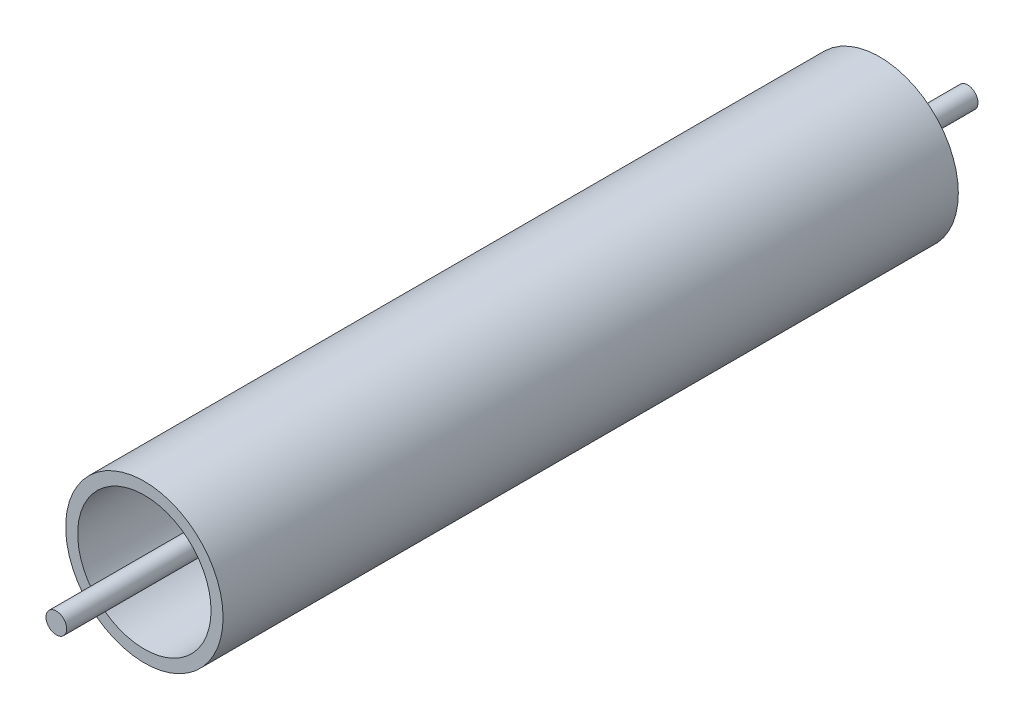
ISO-10303-21;
HEADER;
FILE_DESCRIPTION(('STEP AP214'),'2;1');
FILE_NAME('part.step','',(''),(''),'','','');
FILE_SCHEMA(('AUTOMOTIVE_DESIGN { 1 0 10303 214 1 1 1 1 }'));
ENDSEC;
DATA;
#1=APPLICATION_CONTEXT('core data for automotive mechanical design processes');
#2=APPLICATION_PROTOCOL_DEFINITION('international standard','automotive_design',2000,#1);
#3=PRODUCT_CONTEXT('',#1,'mechanical');
#4=PRODUCT('Part','Part','',(#3));
#5=PRODUCT_RELATED_PRODUCT_CATEGORY('part','',(#4));
#6=PRODUCT_DEFINITION_FORMATION('','',#4);
#7=PRODUCT_DEFINITION_CONTEXT('part definition',#1,'design');
#8=PRODUCT_DEFINITION('design','',#6,#7);
#9=PRODUCT_DEFINITION_SHAPE('','',#8);
#10=(LENGTH_UNIT() NAMED_UNIT(*) SI_UNIT(.MILLI.,.METRE.));
#11=(NAMED_UNIT(*) PLANE_ANGLE_UNIT() SI_UNIT($,.RADIAN.));
#12=(NAMED_UNIT(*) SI_UNIT($,.STERADIAN.) SOLID_ANGLE_UNIT());
#13=UNCERTAINTY_MEASURE_WITH_UNIT(LENGTH_MEASURE(1.E-05),#10,'distance_accuracy_value','');
#14=(GEOMETRIC_REPRESENTATION_CONTEXT(3) GLOBAL_UNCERTAINTY_ASSIGNED_CONTEXT((#13)) GLOBAL_UNIT_ASSIGNED_CONTEXT((#10,
#11,#12)) REPRESENTATION_CONTEXT('',''));
#15=CARTESIAN_POINT('',(0.,0.,0.));
#16=DIRECTION('',(0.,0.,1.));
#17=DIRECTION('',(1.,0.,0.));
#18=AXIS2_PLACEMENT_3D('',#15,#16,#17);
#19=CARTESIAN_POINT('',(0.,0.,112.7125));
#20=DIRECTION('',(0.,0.,1.));
#21=DIRECTION('',(1.,0.,0.));
#22=AXIS2_PLACEMENT_3D('',#19,#20,#21);
#23=PLANE('',#22);
#24=CARTESIAN_POINT('',(0.,0.,112.7125));
#25=DIRECTION('',(0.,0.,1.));
#26=DIRECTION('',(1.,0.,0.));
#27=AXIS2_PLACEMENT_3D('',#24,#25,#26);
#28=CIRCLE('',#27,24.13);
#29=CARTESIAN_POINT('',(24.13,0.,112.7125));
#30=VERTEX_POINT('',#29);
#31=EDGE_CURVE('E11',#30,#30,#28,.T.);
#32=ORIENTED_EDGE('',*,*,#31,.T.);
#33=EDGE_LOOP('',(#32));
#34=FACE_BOUND('',#33,.T.);
#35=CARTESIAN_POINT('',(0.,0.,112.7125));
#36=DIRECTION('',(0.,0.,1.));
#37=DIRECTION('',(1.,0.,0.));
#38=AXIS2_PLACEMENT_3D('',#35,#36,#37);
#39=CIRCLE('',#38,20.447);
#40=CARTESIAN_POINT('',(20.447,0.,112.7125));
#41=VERTEX_POINT('',#40);
#42=EDGE_CURVE('E58',#41,#41,#39,.T.);
#43=ORIENTED_EDGE('',*,*,#42,.F.);
#44=EDGE_LOOP('',(#43));
#45=FACE_BOUND('',#44,.T.);
#46=ADVANCED_FACE('F45',(#34,#45),#23,.T.);
#47=CARTESIAN_POINT('',(0.,0.,-112.7125));
#48=DIRECTION('',(0.,0.,1.));
#49=DIRECTION('',(1.,0.,0.));
#50=AXIS2_PLACEMENT_3D('',#47,#48,#49);
#51=PLANE('',#50);
#52=CARTESIAN_POINT('',(0.,0.,-112.7125));
#53=DIRECTION('',(0.,0.,1.));
#54=DIRECTION('',(1.,0.,0.));
#55=AXIS2_PLACEMENT_3D('',#52,#53,#54);
#56=CIRCLE('',#55,24.13);
#57=CARTESIAN_POINT('',(24.13,0.,-112.7125));
#58=VERTEX_POINT('',#57);
#59=EDGE_CURVE('E49',#58,#58,#56,.T.);
#60=ORIENTED_EDGE('',*,*,#59,.F.);
#61=EDGE_LOOP('',(#60));
#62=FACE_BOUND('',#61,.T.);
#63=CARTESIAN_POINT('',(0.,0.,-112.7125));
#64=DIRECTION('',(0.,0.,1.));
#65=DIRECTION('',(1.,0.,0.));
#66=AXIS2_PLACEMENT_3D('',#63,#64,#65);
#67=CIRCLE('',#66,20.447);
#68=CARTESIAN_POINT('',(20.447,0.,-112.7125));
#69=VERTEX_POINT('',#68);
#70=EDGE_CURVE('E60',#69,#69,#67,.T.);
#71=ORIENTED_EDGE('',*,*,#70,.T.);
#72=EDGE_LOOP('',(#71));
#73=FACE_BOUND('',#72,.T.);
#74=ADVANCED_FACE('F72',(#62,#73),#51,.F.);
#75=CARTESIAN_POINT('',(0.,0.,112.7125));
#76=DIRECTION('',(0.,0.,-1.));
#77=DIRECTION('',(-1.,0.,0.));
#78=AXIS2_PLACEMENT_3D('',#75,#76,#77);
#79=CYLINDRICAL_SURFACE('',#78,24.13);
#80=ORIENTED_EDGE('',*,*,#31,.F.);
#81=EDGE_LOOP('',(#80));
#82=FACE_BOUND('',#81,.T.);
#83=ORIENTED_EDGE('',*,*,#59,.T.);
#84=EDGE_LOOP('',(#83));
#85=FACE_BOUND('',#84,.T.);
#86=ADVANCED_FACE('F47',(#82,#85),#79,.T.);
#87=CARTESIAN_POINT('',(0.,0.,112.7125));
#88=DIRECTION('',(0.,0.,-1.));
#89=DIRECTION('',(-1.,0.,0.));
#90=AXIS2_PLACEMENT_3D('',#87,#88,#89);
#91=CYLINDRICAL_SURFACE('',#90,20.447);
#92=ORIENTED_EDGE('',*,*,#42,.T.);
#93=EDGE_LOOP('',(#92));
#94=FACE_BOUND('',#93,.T.);
#95=ORIENTED_EDGE('',*,*,#70,.F.);
#96=EDGE_LOOP('',(#95));
#97=FACE_BOUND('',#96,.T.);
#98=ADVANCED_FACE('F68',(#94,#97),#91,.F.);
#99=CLOSED_SHELL('',(#46,#74,#86,#98));
#100=MANIFOLD_SOLID_BREP('B2',#99);
#101=CARTESIAN_POINT('',(0.,0.,139.7));
#102=DIRECTION('',(0.,0.,-1.));
#103=DIRECTION('',(-1.,0.,0.));
#104=AXIS2_PLACEMENT_3D('',#101,#102,#103);
#105=CYLINDRICAL_SURFACE('',#104,3.175);
#106=CARTESIAN_POINT('',(0.,0.,139.7));
#107=DIRECTION('',(0.,0.,1.));
#108=DIRECTION('',(1.,0.,0.));
#109=AXIS2_PLACEMENT_3D('',#106,#107,#108);
#110=CIRCLE('',#109,3.175);
#111=CARTESIAN_POINT('',(3.175,0.,139.7));
#112=VERTEX_POINT('',#111);
#113=EDGE_CURVE('E44',#112,#112,#110,.T.);
#114=ORIENTED_EDGE('',*,*,#113,.F.);
#115=EDGE_LOOP('',(#114));
#116=FACE_BOUND('',#115,.T.);
#117=CARTESIAN_POINT('',(0.,0.,-139.7));
#118=DIRECTION('',(0.,0.,1.));
#119=DIRECTION('',(1.,0.,0.));
#120=AXIS2_PLACEMENT_3D('',#117,#118,#119);
#121=CIRCLE('',#120,3.175);
#122=CARTESIAN_POINT('',(3.175,0.,-139.7));
#123=VERTEX_POINT('',#122);
#124=EDGE_CURVE('E114',#123,#123,#121,.T.);
#125=ORIENTED_EDGE('',*,*,#124,.T.);
#126=EDGE_LOOP('',(#125));
#127=FACE_BOUND('',#126,.T.);
#128=ADVANCED_FACE('F111',(#116,#127),#105,.T.);
#129=CARTESIAN_POINT('',(0.,0.,139.7));
#130=DIRECTION('',(0.,0.,1.));
#131=DIRECTION('',(1.,0.,0.));
#132=AXIS2_PLACEMENT_3D('',#129,#130,#131);
#133=PLANE('',#132);
#134=ORIENTED_EDGE('',*,*,#113,.T.);
#135=EDGE_LOOP('',(#134));
#136=FACE_BOUND('',#135,.T.);
#137=ADVANCED_FACE('F126',(#136),#133,.T.);
#138=CARTESIAN_POINT('',(0.,0.,-139.7));
#139=DIRECTION('',(0.,0.,1.));
#140=DIRECTION('',(1.,0.,0.));
#141=AXIS2_PLACEMENT_3D('',#138,#139,#140);
#142=PLANE('',#141);
#143=ORIENTED_EDGE('',*,*,#124,.F.);
#144=EDGE_LOOP('',(#143));
#145=FACE_BOUND('',#144,.T.);
#146=ADVANCED_FACE('F124',(#145),#142,.F.);
#147=CLOSED_SHELL('',(#128,#137,#146));
#148=MANIFOLD_SOLID_BREP('B6',#147);
#149=ADVANCED_BREP_SHAPE_REPRESENTATION('',(#18,#100,#148),#14);
#150=SHAPE_DEFINITION_REPRESENTATION(#9,#149);
ENDSEC;
END-ISO-10303-21;
